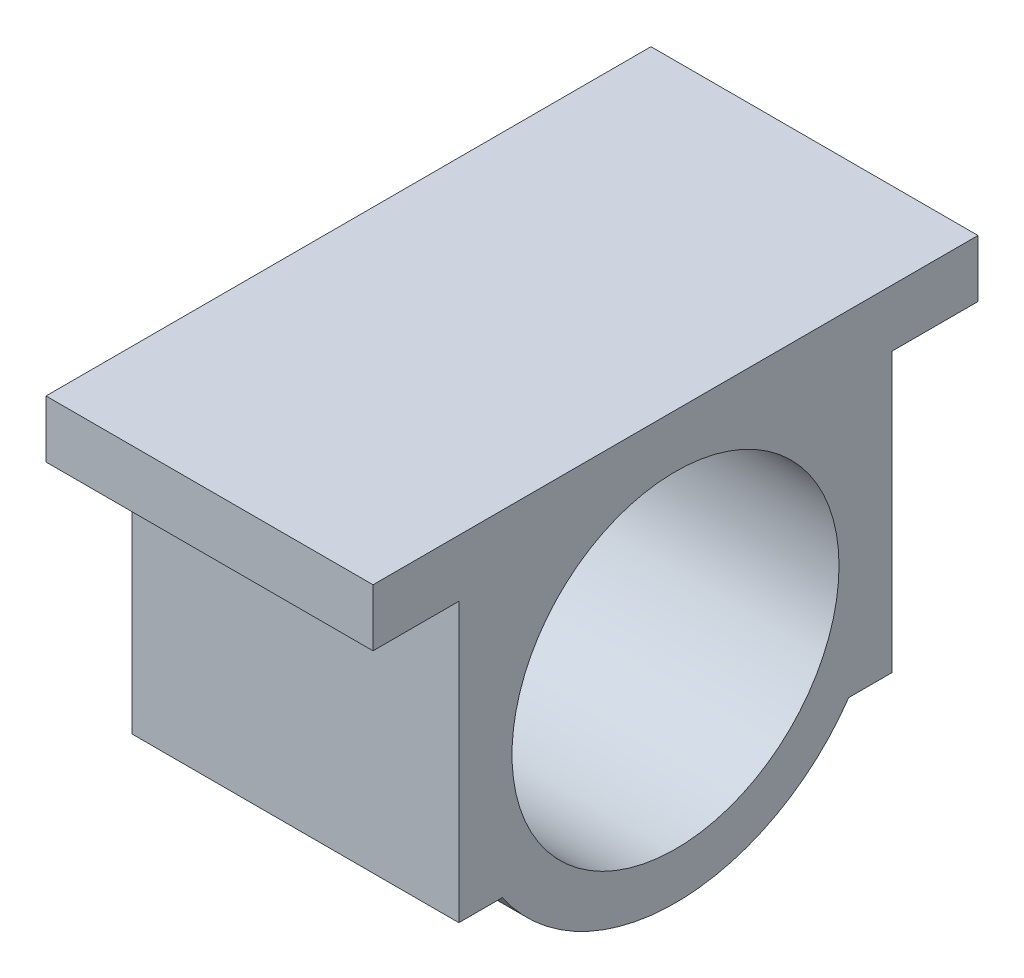
ISO-10303-21;
HEADER;
FILE_DESCRIPTION(('STEP AP214'),'2;1');
FILE_NAME('part.step','',(''),(''),'','','');
FILE_SCHEMA(('AUTOMOTIVE_DESIGN { 1 0 10303 214 1 1 1 1 }'));
ENDSEC;
DATA;
#1=APPLICATION_CONTEXT('core data for automotive mechanical design processes');
#2=APPLICATION_PROTOCOL_DEFINITION('international standard','automotive_design',2000,#1);
#3=PRODUCT_CONTEXT('',#1,'mechanical');
#4=PRODUCT('Part','Part','',(#3));
#5=PRODUCT_RELATED_PRODUCT_CATEGORY('part','',(#4));
#6=PRODUCT_DEFINITION_FORMATION('','',#4);
#7=PRODUCT_DEFINITION_CONTEXT('part definition',#1,'design');
#8=PRODUCT_DEFINITION('design','',#6,#7);
#9=PRODUCT_DEFINITION_SHAPE('','',#8);
#10=(LENGTH_UNIT() NAMED_UNIT(*) SI_UNIT(.MILLI.,.METRE.));
#11=(NAMED_UNIT(*) PLANE_ANGLE_UNIT() SI_UNIT($,.RADIAN.));
#12=(NAMED_UNIT(*) SI_UNIT($,.STERADIAN.) SOLID_ANGLE_UNIT());
#13=UNCERTAINTY_MEASURE_WITH_UNIT(LENGTH_MEASURE(1.E-05),#10,'distance_accuracy_value','');
#14=(GEOMETRIC_REPRESENTATION_CONTEXT(3) GLOBAL_UNCERTAINTY_ASSIGNED_CONTEXT((#13)) GLOBAL_UNIT_ASSIGNED_CONTEXT((#10,
#11,#12)) REPRESENTATION_CONTEXT('',''));
#15=CARTESIAN_POINT('',(0.,0.,0.));
#16=DIRECTION('',(0.,0.,1.));
#17=DIRECTION('',(1.,0.,0.));
#18=AXIS2_PLACEMENT_3D('',#15,#16,#17);
#19=CARTESIAN_POINT('',(40.,0.,0.));
#20=DIRECTION('',(1.,0.,0.));
#21=DIRECTION('',(0.,0.,-1.));
#22=AXIS2_PLACEMENT_3D('',#19,#20,#21);
#23=PLANE('',#22);
#24=DIRECTION('',(0.,-1.,0.));
#25=VECTOR('',#24,1.);
#26=CARTESIAN_POINT('',(40.,-29.1,53.));
#27=LINE('',#26,#25);
#28=CARTESIAN_POINT('',(40.,39.,53.));
#29=VERTEX_POINT('',#28);
#30=CARTESIAN_POINT('',(40.,-29.1,53.));
#31=VERTEX_POINT('',#30);
#32=EDGE_CURVE('E182',#29,#31,#27,.T.);
#33=ORIENTED_EDGE('',*,*,#32,.T.);
#34=DIRECTION('',(0.,0.,-1.));
#35=VECTOR('',#34,1.);
#36=CARTESIAN_POINT('',(40.,-29.1,53.));
#37=LINE('',#36,#35);
#38=CARTESIAN_POINT('',(40.,-29.1,42.3692105189606));
#39=VERTEX_POINT('',#38);
#40=EDGE_CURVE('E106',#31,#39,#37,.T.);
#41=ORIENTED_EDGE('',*,*,#40,.T.);
#42=CARTESIAN_POINT('',(40.,0.,0.));
#43=DIRECTION('',(1.,0.,0.));
#44=DIRECTION('',(0.,0.,-1.));
#45=AXIS2_PLACEMENT_3D('',#42,#43,#44);
#46=CIRCLE('',#45,51.4);
#47=CARTESIAN_POINT('',(40.,-29.1,-42.3692105189606));
#48=VERTEX_POINT('',#47);
#49=EDGE_CURVE('E211',#39,#48,#46,.T.);
#50=ORIENTED_EDGE('',*,*,#49,.T.);
#51=DIRECTION('',(0.,0.,-1.));
#52=VECTOR('',#51,1.);
#53=CARTESIAN_POINT('',(40.,-29.1,-53.));
#54=LINE('',#53,#52);
#55=CARTESIAN_POINT('',(40.,-29.1,-53.));
#56=VERTEX_POINT('',#55);
#57=EDGE_CURVE('E231',#48,#56,#54,.T.);
#58=ORIENTED_EDGE('',*,*,#57,.T.);
#59=DIRECTION('',(0.,1.,0.));
#60=VECTOR('',#59,1.);
#61=CARTESIAN_POINT('',(40.,-29.1,-53.));
#62=LINE('',#61,#60);
#63=CARTESIAN_POINT('',(40.,39.,-53.));
#64=VERTEX_POINT('',#63);
#65=EDGE_CURVE('E227',#56,#64,#62,.T.);
#66=ORIENTED_EDGE('',*,*,#65,.T.);
#67=DIRECTION('',(0.,0.,-1.));
#68=VECTOR('',#67,1.);
#69=CARTESIAN_POINT('',(40.,39.,-53.));
#70=LINE('',#69,#68);
#71=CARTESIAN_POINT('',(40.,39.,-74.));
#72=VERTEX_POINT('',#71);
#73=EDGE_CURVE('E230',#64,#72,#70,.T.);
#74=ORIENTED_EDGE('',*,*,#73,.T.);
#75=DIRECTION('',(0.,1.,0.));
#76=VECTOR('',#75,1.);
#77=CARTESIAN_POINT('',(40.,39.,-74.));
#78=LINE('',#77,#76);
#79=CARTESIAN_POINT('',(40.,53.,-74.));
#80=VERTEX_POINT('',#79);
#81=EDGE_CURVE('E131',#72,#80,#78,.T.);
#82=ORIENTED_EDGE('',*,*,#81,.T.);
#83=DIRECTION('',(0.,0.,1.));
#84=VECTOR('',#83,1.);
#85=CARTESIAN_POINT('',(40.,53.,74.));
#86=LINE('',#85,#84);
#87=CARTESIAN_POINT('',(40.,53.,74.));
#88=VERTEX_POINT('',#87);
#89=EDGE_CURVE('E125',#80,#88,#86,.T.);
#90=ORIENTED_EDGE('',*,*,#89,.T.);
#91=DIRECTION('',(0.,-1.,0.));
#92=VECTOR('',#91,1.);
#93=CARTESIAN_POINT('',(40.,39.,74.));
#94=LINE('',#93,#92);
#95=CARTESIAN_POINT('',(40.,39.,74.));
#96=VERTEX_POINT('',#95);
#97=EDGE_CURVE('E129',#88,#96,#94,.T.);
#98=ORIENTED_EDGE('',*,*,#97,.T.);
#99=DIRECTION('',(0.,0.,-1.));
#100=VECTOR('',#99,1.);
#101=CARTESIAN_POINT('',(40.,39.,53.));
#102=LINE('',#101,#100);
#103=EDGE_CURVE('E57',#96,#29,#102,.T.);
#104=ORIENTED_EDGE('',*,*,#103,.T.);
#105=EDGE_LOOP('',(#33,#41,#50,#58,#66,#74,#82,#90,#98,#104));
#106=FACE_BOUND('',#105,.T.);
#107=CARTESIAN_POINT('',(40.,0.,0.));
#108=DIRECTION('',(1.,0.,0.));
#109=DIRECTION('',(0.,0.,-1.));
#110=AXIS2_PLACEMENT_3D('',#107,#108,#109);
#111=CIRCLE('',#110,40.);
#112=CARTESIAN_POINT('',(40.,0.,-40.));
#113=VERTEX_POINT('',#112);
#114=EDGE_CURVE('E158',#113,#113,#111,.T.);
#115=ORIENTED_EDGE('',*,*,#114,.F.);
#116=EDGE_LOOP('',(#115));
#117=FACE_BOUND('',#116,.T.);
#118=ADVANCED_FACE('F39',(#106,#117),#23,.T.);
#119=CARTESIAN_POINT('',(-40.,0.,0.));
#120=DIRECTION('',(1.,0.,0.));
#121=DIRECTION('',(0.,0.,-1.));
#122=AXIS2_PLACEMENT_3D('',#119,#120,#121);
#123=PLANE('',#122);
#124=DIRECTION('',(0.,-1.,0.));
#125=VECTOR('',#124,1.);
#126=CARTESIAN_POINT('',(-40.,-29.1,53.));
#127=LINE('',#126,#125);
#128=CARTESIAN_POINT('',(-40.,39.,53.));
#129=VERTEX_POINT('',#128);
#130=CARTESIAN_POINT('',(-40.,-29.1,53.));
#131=VERTEX_POINT('',#130);
#132=EDGE_CURVE('E153',#129,#131,#127,.T.);
#133=ORIENTED_EDGE('',*,*,#132,.F.);
#134=DIRECTION('',(0.,0.,-1.));
#135=VECTOR('',#134,1.);
#136=CARTESIAN_POINT('',(-40.,39.,53.));
#137=LINE('',#136,#135);
#138=CARTESIAN_POINT('',(-40.,39.,74.));
#139=VERTEX_POINT('',#138);
#140=EDGE_CURVE('E98',#139,#129,#137,.T.);
#141=ORIENTED_EDGE('',*,*,#140,.F.);
#142=DIRECTION('',(0.,-1.,0.));
#143=VECTOR('',#142,1.);
#144=CARTESIAN_POINT('',(-40.,39.,74.));
#145=LINE('',#144,#143);
#146=CARTESIAN_POINT('',(-40.,53.,74.));
#147=VERTEX_POINT('',#146);
#148=EDGE_CURVE('E92',#147,#139,#145,.T.);
#149=ORIENTED_EDGE('',*,*,#148,.F.);
#150=DIRECTION('',(0.,0.,1.));
#151=VECTOR('',#150,1.);
#152=CARTESIAN_POINT('',(-40.,53.,74.));
#153=LINE('',#152,#151);
#154=CARTESIAN_POINT('',(-40.,53.,-74.));
#155=VERTEX_POINT('',#154);
#156=EDGE_CURVE('E140',#155,#147,#153,.T.);
#157=ORIENTED_EDGE('',*,*,#156,.F.);
#158=DIRECTION('',(0.,1.,0.));
#159=VECTOR('',#158,1.);
#160=CARTESIAN_POINT('',(-40.,39.,-74.));
#161=LINE('',#160,#159);
#162=CARTESIAN_POINT('',(-40.,39.,-74.));
#163=VERTEX_POINT('',#162);
#164=EDGE_CURVE('E173',#163,#155,#161,.T.);
#165=ORIENTED_EDGE('',*,*,#164,.F.);
#166=DIRECTION('',(0.,0.,-1.));
#167=VECTOR('',#166,1.);
#168=CARTESIAN_POINT('',(-40.,39.,-53.));
#169=LINE('',#168,#167);
#170=CARTESIAN_POINT('',(-40.,39.,-53.));
#171=VERTEX_POINT('',#170);
#172=EDGE_CURVE('E170',#171,#163,#169,.T.);
#173=ORIENTED_EDGE('',*,*,#172,.F.);
#174=DIRECTION('',(0.,1.,0.));
#175=VECTOR('',#174,1.);
#176=CARTESIAN_POINT('',(-40.,-29.1,-53.));
#177=LINE('',#176,#175);
#178=CARTESIAN_POINT('',(-40.,-29.1,-53.));
#179=VERTEX_POINT('',#178);
#180=EDGE_CURVE('E167',#179,#171,#177,.T.);
#181=ORIENTED_EDGE('',*,*,#180,.F.);
#182=DIRECTION('',(0.,0.,-1.));
#183=VECTOR('',#182,1.);
#184=CARTESIAN_POINT('',(-40.,-29.1,-53.));
#185=LINE('',#184,#183);
#186=CARTESIAN_POINT('',(-40.,-29.1,-42.3692105189606));
#187=VERTEX_POINT('',#186);
#188=EDGE_CURVE('E164',#187,#179,#185,.T.);
#189=ORIENTED_EDGE('',*,*,#188,.F.);
#190=CARTESIAN_POINT('',(-40.,0.,0.));
#191=DIRECTION('',(1.,0.,0.));
#192=DIRECTION('',(0.,0.,-1.));
#193=AXIS2_PLACEMENT_3D('',#190,#191,#192);
#194=CIRCLE('',#193,51.4);
#195=CARTESIAN_POINT('',(-40.,-29.1,42.3692105189606));
#196=VERTEX_POINT('',#195);
#197=EDGE_CURVE('E161',#196,#187,#194,.T.);
#198=ORIENTED_EDGE('',*,*,#197,.F.);
#199=DIRECTION('',(0.,0.,-1.));
#200=VECTOR('',#199,1.);
#201=CARTESIAN_POINT('',(-40.,-29.1,53.));
#202=LINE('',#201,#200);
#203=EDGE_CURVE('E157',#131,#196,#202,.T.);
#204=ORIENTED_EDGE('',*,*,#203,.F.);
#205=EDGE_LOOP('',(#133,#141,#149,#157,#165,#173,#181,#189,#198,#204));
#206=FACE_BOUND('',#205,.T.);
#207=CARTESIAN_POINT('',(-40.,0.,0.));
#208=DIRECTION('',(1.,0.,0.));
#209=DIRECTION('',(0.,0.,-1.));
#210=AXIS2_PLACEMENT_3D('',#207,#208,#209);
#211=CIRCLE('',#210,40.);
#212=CARTESIAN_POINT('',(-40.,0.,-40.));
#213=VERTEX_POINT('',#212);
#214=EDGE_CURVE('E245',#213,#213,#211,.T.);
#215=ORIENTED_EDGE('',*,*,#214,.T.);
#216=EDGE_LOOP('',(#215));
#217=FACE_BOUND('',#216,.T.);
#218=ADVANCED_FACE('F215',(#206,#217),#123,.F.);
#219=CARTESIAN_POINT('',(40.,-29.1,53.));
#220=DIRECTION('',(0.,0.,-1.));
#221=DIRECTION('',(-1.,0.,0.));
#222=AXIS2_PLACEMENT_3D('',#219,#220,#221);
#223=PLANE('',#222);
#224=ORIENTED_EDGE('',*,*,#132,.T.);
#225=DIRECTION('',(-1.,0.,0.));
#226=VECTOR('',#225,1.);
#227=CARTESIAN_POINT('',(40.,-29.1,53.));
#228=LINE('',#227,#226);
#229=EDGE_CURVE('E11',#31,#131,#228,.T.);
#230=ORIENTED_EDGE('',*,*,#229,.F.);
#231=ORIENTED_EDGE('',*,*,#32,.F.);
#232=DIRECTION('',(-1.,0.,0.));
#233=VECTOR('',#232,1.);
#234=CARTESIAN_POINT('',(40.,39.,53.));
#235=LINE('',#234,#233);
#236=EDGE_CURVE('E149',#29,#129,#235,.T.);
#237=ORIENTED_EDGE('',*,*,#236,.T.);
#238=EDGE_LOOP('',(#224,#230,#231,#237));
#239=FACE_BOUND('',#238,.T.);
#240=ADVANCED_FACE('F41',(#239),#223,.F.);
#241=CARTESIAN_POINT('',(40.,-29.1,53.));
#242=DIRECTION('',(0.,1.,0.));
#243=DIRECTION('',(0.,0.,1.));
#244=AXIS2_PLACEMENT_3D('',#241,#242,#243);
#245=PLANE('',#244);
#246=ORIENTED_EDGE('',*,*,#203,.T.);
#247=DIRECTION('',(-1.,0.,0.));
#248=VECTOR('',#247,1.);
#249=CARTESIAN_POINT('',(40.,-29.1,42.3692105189606));
#250=LINE('',#249,#248);
#251=EDGE_CURVE('E49',#39,#196,#250,.T.);
#252=ORIENTED_EDGE('',*,*,#251,.F.);
#253=ORIENTED_EDGE('',*,*,#40,.F.);
#254=ORIENTED_EDGE('',*,*,#229,.T.);
#255=EDGE_LOOP('',(#246,#252,#253,#254));
#256=FACE_BOUND('',#255,.T.);
#257=ADVANCED_FACE('F283',(#256),#245,.F.);
#258=CARTESIAN_POINT('',(40.,0.,0.));
#259=DIRECTION('',(-1.,0.,0.));
#260=DIRECTION('',(0.,0.,1.));
#261=AXIS2_PLACEMENT_3D('',#258,#259,#260);
#262=CYLINDRICAL_SURFACE('',#261,51.4);
#263=ORIENTED_EDGE('',*,*,#197,.T.);
#264=DIRECTION('',(-1.,0.,0.));
#265=VECTOR('',#264,1.);
#266=CARTESIAN_POINT('',(40.,-29.1,-42.3692105189606));
#267=LINE('',#266,#265);
#268=EDGE_CURVE('E201',#48,#187,#267,.T.);
#269=ORIENTED_EDGE('',*,*,#268,.F.);
#270=ORIENTED_EDGE('',*,*,#49,.F.);
#271=ORIENTED_EDGE('',*,*,#251,.T.);
#272=EDGE_LOOP('',(#263,#269,#270,#271));
#273=FACE_BOUND('',#272,.T.);
#274=ADVANCED_FACE('F209',(#273),#262,.T.);
#275=CARTESIAN_POINT('',(40.,-29.1,-53.));
#276=DIRECTION('',(0.,1.,0.));
#277=DIRECTION('',(0.,0.,1.));
#278=AXIS2_PLACEMENT_3D('',#275,#276,#277);
#279=PLANE('',#278);
#280=ORIENTED_EDGE('',*,*,#188,.T.);
#281=DIRECTION('',(-1.,0.,0.));
#282=VECTOR('',#281,1.);
#283=CARTESIAN_POINT('',(40.,-29.1,-53.));
#284=LINE('',#283,#282);
#285=EDGE_CURVE('E197',#56,#179,#284,.T.);
#286=ORIENTED_EDGE('',*,*,#285,.F.);
#287=ORIENTED_EDGE('',*,*,#57,.F.);
#288=ORIENTED_EDGE('',*,*,#268,.T.);
#289=EDGE_LOOP('',(#280,#286,#287,#288));
#290=FACE_BOUND('',#289,.T.);
#291=ADVANCED_FACE('F221',(#290),#279,.F.);
#292=CARTESIAN_POINT('',(40.,-29.1,-53.));
#293=DIRECTION('',(0.,0.,1.));
#294=DIRECTION('',(0.,-1.,0.));
#295=AXIS2_PLACEMENT_3D('',#292,#293,#294);
#296=PLANE('',#295);
#297=ORIENTED_EDGE('',*,*,#180,.T.);
#298=DIRECTION('',(-1.,0.,0.));
#299=VECTOR('',#298,1.);
#300=CARTESIAN_POINT('',(40.,39.,-53.));
#301=LINE('',#300,#299);
#302=EDGE_CURVE('E193',#64,#171,#301,.T.);
#303=ORIENTED_EDGE('',*,*,#302,.F.);
#304=ORIENTED_EDGE('',*,*,#65,.F.);
#305=ORIENTED_EDGE('',*,*,#285,.T.);
#306=EDGE_LOOP('',(#297,#303,#304,#305));
#307=FACE_BOUND('',#306,.T.);
#308=ADVANCED_FACE('F225',(#307),#296,.F.);
#309=CARTESIAN_POINT('',(40.,39.,-53.));
#310=DIRECTION('',(0.,1.,0.));
#311=DIRECTION('',(0.,0.,1.));
#312=AXIS2_PLACEMENT_3D('',#309,#310,#311);
#313=PLANE('',#312);
#314=ORIENTED_EDGE('',*,*,#172,.T.);
#315=DIRECTION('',(-1.,0.,0.));
#316=VECTOR('',#315,1.);
#317=CARTESIAN_POINT('',(40.,39.,-74.));
#318=LINE('',#317,#316);
#319=EDGE_CURVE('E189',#72,#163,#318,.T.);
#320=ORIENTED_EDGE('',*,*,#319,.F.);
#321=ORIENTED_EDGE('',*,*,#73,.F.);
#322=ORIENTED_EDGE('',*,*,#302,.T.);
#323=EDGE_LOOP('',(#314,#320,#321,#322));
#324=FACE_BOUND('',#323,.T.);
#325=ADVANCED_FACE('F273',(#324),#313,.F.);
#326=CARTESIAN_POINT('',(40.,39.,-74.));
#327=DIRECTION('',(0.,0.,1.));
#328=DIRECTION('',(0.,-1.,0.));
#329=AXIS2_PLACEMENT_3D('',#326,#327,#328);
#330=PLANE('',#329);
#331=ORIENTED_EDGE('',*,*,#164,.T.);
#332=DIRECTION('',(-1.,0.,0.));
#333=VECTOR('',#332,1.);
#334=CARTESIAN_POINT('',(40.,53.,-74.));
#335=LINE('',#334,#333);
#336=EDGE_CURVE('E142',#80,#155,#335,.T.);
#337=ORIENTED_EDGE('',*,*,#336,.F.);
#338=ORIENTED_EDGE('',*,*,#81,.F.);
#339=ORIENTED_EDGE('',*,*,#319,.T.);
#340=EDGE_LOOP('',(#331,#337,#338,#339));
#341=FACE_BOUND('',#340,.T.);
#342=ADVANCED_FACE('F270',(#341),#330,.F.);
#343=CARTESIAN_POINT('',(40.,53.,74.));
#344=DIRECTION('',(0.,-1.,0.));
#345=DIRECTION('',(0.,0.,-1.));
#346=AXIS2_PLACEMENT_3D('',#343,#344,#345);
#347=PLANE('',#346);
#348=ORIENTED_EDGE('',*,*,#156,.T.);
#349=DIRECTION('',(-1.,0.,0.));
#350=VECTOR('',#349,1.);
#351=CARTESIAN_POINT('',(40.,53.,74.));
#352=LINE('',#351,#350);
#353=EDGE_CURVE('E137',#88,#147,#352,.T.);
#354=ORIENTED_EDGE('',*,*,#353,.F.);
#355=ORIENTED_EDGE('',*,*,#89,.F.);
#356=ORIENTED_EDGE('',*,*,#336,.T.);
#357=EDGE_LOOP('',(#348,#354,#355,#356));
#358=FACE_BOUND('',#357,.T.);
#359=ADVANCED_FACE('F138',(#358),#347,.F.);
#360=CARTESIAN_POINT('',(40.,39.,74.));
#361=DIRECTION('',(0.,0.,-1.));
#362=DIRECTION('',(0.,1.,0.));
#363=AXIS2_PLACEMENT_3D('',#360,#361,#362);
#364=PLANE('',#363);
#365=ORIENTED_EDGE('',*,*,#148,.T.);
#366=DIRECTION('',(-1.,0.,0.));
#367=VECTOR('',#366,1.);
#368=CARTESIAN_POINT('',(40.,39.,74.));
#369=LINE('',#368,#367);
#370=EDGE_CURVE('E143',#96,#139,#369,.T.);
#371=ORIENTED_EDGE('',*,*,#370,.F.);
#372=ORIENTED_EDGE('',*,*,#97,.F.);
#373=ORIENTED_EDGE('',*,*,#353,.T.);
#374=EDGE_LOOP('',(#365,#371,#372,#373));
#375=FACE_BOUND('',#374,.T.);
#376=ADVANCED_FACE('F145',(#375),#364,.F.);
#377=CARTESIAN_POINT('',(40.,39.,53.));
#378=DIRECTION('',(0.,1.,0.));
#379=DIRECTION('',(0.,0.,1.));
#380=AXIS2_PLACEMENT_3D('',#377,#378,#379);
#381=PLANE('',#380);
#382=ORIENTED_EDGE('',*,*,#140,.T.);
#383=ORIENTED_EDGE('',*,*,#236,.F.);
#384=ORIENTED_EDGE('',*,*,#103,.F.);
#385=ORIENTED_EDGE('',*,*,#370,.T.);
#386=EDGE_LOOP('',(#382,#383,#384,#385));
#387=FACE_BOUND('',#386,.T.);
#388=ADVANCED_FACE('F263',(#387),#381,.F.);
#389=CARTESIAN_POINT('',(40.,0.,0.));
#390=DIRECTION('',(-1.,0.,0.));
#391=DIRECTION('',(0.,0.,1.));
#392=AXIS2_PLACEMENT_3D('',#389,#390,#391);
#393=CYLINDRICAL_SURFACE('',#392,40.);
#394=ORIENTED_EDGE('',*,*,#114,.T.);
#395=EDGE_LOOP('',(#394));
#396=FACE_BOUND('',#395,.T.);
#397=ORIENTED_EDGE('',*,*,#214,.F.);
#398=EDGE_LOOP('',(#397));
#399=FACE_BOUND('',#398,.T.);
#400=ADVANCED_FACE('F253',(#396,#399),#393,.F.);
#401=CLOSED_SHELL('',(#118,#218,#240,#257,#274,#291,#308,#325,#342,#359,#376,#388,#400));
#402=MANIFOLD_SOLID_BREP('B2',#401);
#403=ADVANCED_BREP_SHAPE_REPRESENTATION('',(#18,#402),#14);
#404=SHAPE_DEFINITION_REPRESENTATION(#9,#403);
ENDSEC;
END-ISO-10303-21;
